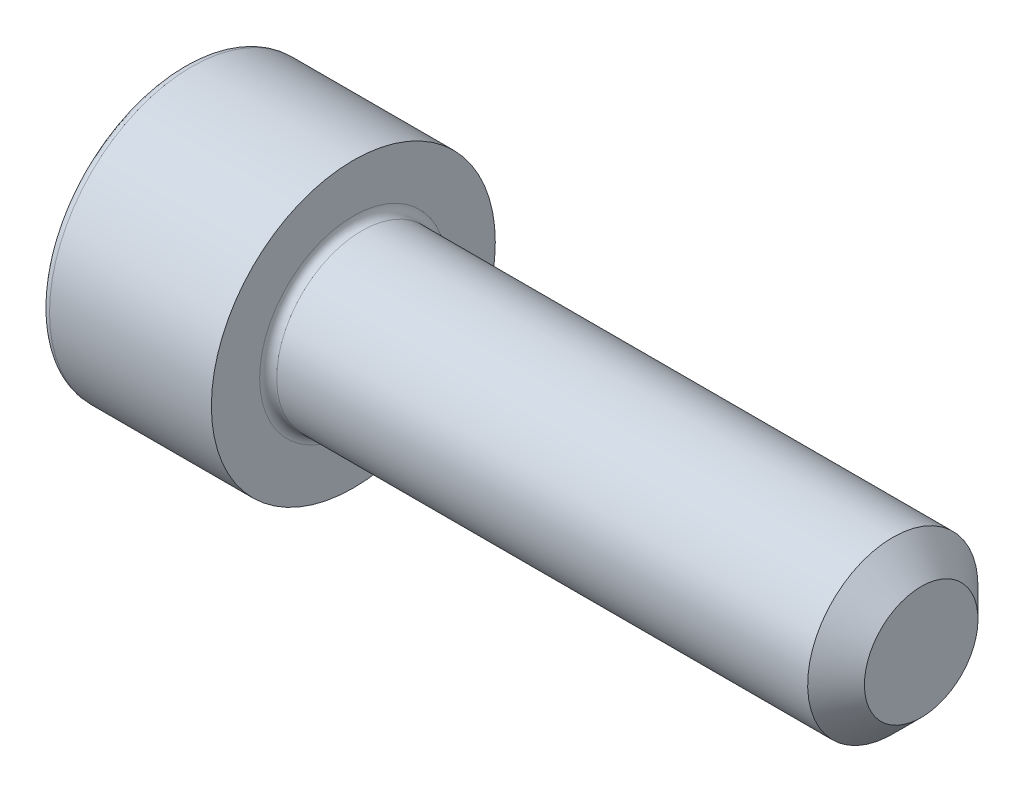
ISO-10303-21;
HEADER;
FILE_DESCRIPTION(('STEP AP214'),'2;1');
FILE_NAME('part.step','',(''),(''),'','','');
FILE_SCHEMA(('AUTOMOTIVE_DESIGN { 1 0 10303 214 1 1 1 1 }'));
ENDSEC;
DATA;
#1=APPLICATION_CONTEXT('core data for automotive mechanical design processes');
#2=APPLICATION_PROTOCOL_DEFINITION('international standard','automotive_design',2000,#1);
#3=PRODUCT_CONTEXT('',#1,'mechanical');
#4=PRODUCT('Part','Part','',(#3));
#5=PRODUCT_RELATED_PRODUCT_CATEGORY('part','',(#4));
#6=PRODUCT_DEFINITION_FORMATION('','',#4);
#7=PRODUCT_DEFINITION_CONTEXT('part definition',#1,'design');
#8=PRODUCT_DEFINITION('design','',#6,#7);
#9=PRODUCT_DEFINITION_SHAPE('','',#8);
#10=(LENGTH_UNIT() NAMED_UNIT(*) SI_UNIT(.MILLI.,.METRE.));
#11=(NAMED_UNIT(*) PLANE_ANGLE_UNIT() SI_UNIT($,.RADIAN.));
#12=(NAMED_UNIT(*) SI_UNIT($,.STERADIAN.) SOLID_ANGLE_UNIT());
#13=UNCERTAINTY_MEASURE_WITH_UNIT(LENGTH_MEASURE(1.E-05),#10,'distance_accuracy_value','');
#14=(GEOMETRIC_REPRESENTATION_CONTEXT(3) GLOBAL_UNCERTAINTY_ASSIGNED_CONTEXT((#13)) GLOBAL_UNIT_ASSIGNED_CONTEXT((#10,
#11,#12)) REPRESENTATION_CONTEXT('',''));
#15=CARTESIAN_POINT('',(0.,0.,0.));
#16=DIRECTION('',(0.,0.,1.));
#17=DIRECTION('',(1.,0.,0.));
#18=AXIS2_PLACEMENT_3D('',#15,#16,#17);
#19=CARTESIAN_POINT('',(0.,0.,0.));
#20=DIRECTION('',(-1.,0.,0.));
#21=DIRECTION('',(0.,-1.,0.));
#22=AXIS2_PLACEMENT_3D('',#19,#20,#21);
#23=PLANE('',#22);
#24=CARTESIAN_POINT('',(0.,0.,0.));
#25=DIRECTION('',(-1.,0.,0.));
#26=DIRECTION('',(0.,-1.,0.));
#27=AXIS2_PLACEMENT_3D('',#24,#25,#26);
#28=CIRCLE('',#27,4.7);
#29=CARTESIAN_POINT('',(0.,-4.7,0.));
#30=VERTEX_POINT('',#29);
#31=EDGE_CURVE('E158',#30,#30,#28,.T.);
#32=ORIENTED_EDGE('',*,*,#31,.T.);
#33=EDGE_LOOP('',(#32));
#34=FACE_BOUND('',#33,.T.);
#35=DIRECTION('',(0.,0.,-1.));
#36=VECTOR('',#35,1.);
#37=CARTESIAN_POINT('',(0.,2.5,1.44337567297407));
#38=LINE('',#37,#36);
#39=CARTESIAN_POINT('',(0.,2.5,1.44337567297407));
#40=VERTEX_POINT('',#39);
#41=CARTESIAN_POINT('',(0.,2.5,-1.44337567297406));
#42=VERTEX_POINT('',#41);
#43=EDGE_CURVE('E54',#40,#42,#38,.T.);
#44=ORIENTED_EDGE('',*,*,#43,.F.);
#45=DIRECTION('',(0.,0.866025403784439,-0.5));
#46=VECTOR('',#45,1.);
#47=CARTESIAN_POINT('',(0.,0.,2.88675134594813));
#48=LINE('',#47,#46);
#49=CARTESIAN_POINT('',(0.,0.,2.88675134594813));
#50=VERTEX_POINT('',#49);
#51=EDGE_CURVE('E137',#50,#40,#48,.T.);
#52=ORIENTED_EDGE('',*,*,#51,.F.);
#53=DIRECTION('',(0.,0.866025403784439,0.5));
#54=VECTOR('',#53,1.);
#55=CARTESIAN_POINT('',(0.,-2.5,1.44337567297406));
#56=LINE('',#55,#54);
#57=CARTESIAN_POINT('',(0.,-2.5,1.44337567297406));
#58=VERTEX_POINT('',#57);
#59=EDGE_CURVE('E135',#58,#50,#56,.T.);
#60=ORIENTED_EDGE('',*,*,#59,.F.);
#61=DIRECTION('',(0.,0.,1.));
#62=VECTOR('',#61,1.);
#63=CARTESIAN_POINT('',(0.,-2.5,-1.44337567297407));
#64=LINE('',#63,#62);
#65=CARTESIAN_POINT('',(0.,-2.5,-1.44337567297407));
#66=VERTEX_POINT('',#65);
#67=EDGE_CURVE('E102',#66,#58,#64,.T.);
#68=ORIENTED_EDGE('',*,*,#67,.F.);
#69=DIRECTION('',(0.,-0.866025403784439,0.5));
#70=VECTOR('',#69,1.);
#71=CARTESIAN_POINT('',(0.,0.,-2.88675134594813));
#72=LINE('',#71,#70);
#73=CARTESIAN_POINT('',(0.,0.,-2.88675134594813));
#74=VERTEX_POINT('',#73);
#75=EDGE_CURVE('E131',#74,#66,#72,.T.);
#76=ORIENTED_EDGE('',*,*,#75,.F.);
#77=DIRECTION('',(0.,-0.866025403784439,-0.5));
#78=VECTOR('',#77,1.);
#79=CARTESIAN_POINT('',(0.,2.5,-1.44337567297406));
#80=LINE('',#79,#78);
#81=EDGE_CURVE('E128',#42,#74,#80,.T.);
#82=ORIENTED_EDGE('',*,*,#81,.F.);
#83=EDGE_LOOP('',(#44,#52,#60,#68,#76,#82));
#84=FACE_BOUND('',#83,.T.);
#85=ADVANCED_FACE('F38',(#34,#84),#23,.T.);
#86=CARTESIAN_POINT('',(26.,0.,0.));
#87=DIRECTION('',(1.,0.,0.));
#88=DIRECTION('',(0.,1.,0.));
#89=AXIS2_PLACEMENT_3D('',#86,#87,#88);
#90=CYLINDRICAL_SURFACE('',#89,5.);
#91=CARTESIAN_POINT('',(0.300000000000002,0.,0.));
#92=DIRECTION('',(-1.,0.,0.));
#93=DIRECTION('',(0.,-1.,0.));
#94=AXIS2_PLACEMENT_3D('',#91,#92,#93);
#95=CIRCLE('',#94,5.);
#96=CARTESIAN_POINT('',(0.300000000000002,-5.,0.));
#97=VERTEX_POINT('',#96);
#98=EDGE_CURVE('E155',#97,#97,#95,.F.);
#99=ORIENTED_EDGE('',*,*,#98,.T.);
#100=EDGE_LOOP('',(#99));
#101=FACE_BOUND('',#100,.T.);
#102=CARTESIAN_POINT('',(6.,0.,0.));
#103=DIRECTION('',(1.,0.,0.));
#104=DIRECTION('',(0.,1.,0.));
#105=AXIS2_PLACEMENT_3D('',#102,#103,#104);
#106=CIRCLE('',#105,5.);
#107=CARTESIAN_POINT('',(6.,5.,0.));
#108=VERTEX_POINT('',#107);
#109=EDGE_CURVE('E141',#108,#108,#106,.T.);
#110=ORIENTED_EDGE('',*,*,#109,.F.);
#111=EDGE_LOOP('',(#110));
#112=FACE_BOUND('',#111,.T.);
#113=ADVANCED_FACE('F175',(#101,#112),#90,.T.);
#114=CARTESIAN_POINT('',(6.,5.,0.));
#115=DIRECTION('',(1.,0.,0.));
#116=DIRECTION('',(0.,1.,0.));
#117=AXIS2_PLACEMENT_3D('',#114,#115,#116);
#118=PLANE('',#117);
#119=CARTESIAN_POINT('',(6.,0.,0.));
#120=DIRECTION('',(1.,0.,0.));
#121=DIRECTION('',(0.,1.,0.));
#122=AXIS2_PLACEMENT_3D('',#119,#120,#121);
#123=CIRCLE('',#122,3.29999999999999);
#124=CARTESIAN_POINT('',(6.,3.3,0.));
#125=VERTEX_POINT('',#124);
#126=EDGE_CURVE('E152',#125,#125,#123,.F.);
#127=ORIENTED_EDGE('',*,*,#126,.T.);
#128=EDGE_LOOP('',(#127));
#129=FACE_BOUND('',#128,.T.);
#130=ORIENTED_EDGE('',*,*,#109,.T.);
#131=EDGE_LOOP('',(#130));
#132=FACE_BOUND('',#131,.T.);
#133=ADVANCED_FACE('F181',(#129,#132),#118,.T.);
#134=CARTESIAN_POINT('',(26.,0.,0.));
#135=DIRECTION('',(1.,0.,0.));
#136=DIRECTION('',(0.,1.,0.));
#137=AXIS2_PLACEMENT_3D('',#134,#135,#136);
#138=CYLINDRICAL_SURFACE('',#137,2.99999999999999);
#139=CARTESIAN_POINT('',(25.,0.,0.));
#140=DIRECTION('',(1.,0.,0.));
#141=DIRECTION('',(0.,1.,0.));
#142=AXIS2_PLACEMENT_3D('',#139,#140,#141);
#143=CIRCLE('',#142,2.99999999999999);
#144=CARTESIAN_POINT('',(25.,3.,0.));
#145=VERTEX_POINT('',#144);
#146=EDGE_CURVE('E11',#145,#145,#143,.F.);
#147=ORIENTED_EDGE('',*,*,#146,.T.);
#148=EDGE_LOOP('',(#147));
#149=FACE_BOUND('',#148,.T.);
#150=CARTESIAN_POINT('',(6.3,0.,0.));
#151=DIRECTION('',(1.,0.,0.));
#152=DIRECTION('',(0.,1.,0.));
#153=AXIS2_PLACEMENT_3D('',#150,#151,#152);
#154=CIRCLE('',#153,2.99999999999999);
#155=CARTESIAN_POINT('',(6.3,3.,0.));
#156=VERTEX_POINT('',#155);
#157=EDGE_CURVE('E149',#156,#156,#154,.T.);
#158=ORIENTED_EDGE('',*,*,#157,.T.);
#159=EDGE_LOOP('',(#158));
#160=FACE_BOUND('',#159,.T.);
#161=ADVANCED_FACE('F198',(#149,#160),#138,.T.);
#162=CARTESIAN_POINT('',(26.,3.,0.));
#163=DIRECTION('',(1.,0.,0.));
#164=DIRECTION('',(0.,1.,0.));
#165=AXIS2_PLACEMENT_3D('',#162,#163,#164);
#166=PLANE('',#165);
#167=CARTESIAN_POINT('',(26.,0.,0.));
#168=DIRECTION('',(1.,0.,0.));
#169=DIRECTION('',(0.,1.,0.));
#170=AXIS2_PLACEMENT_3D('',#167,#168,#169);
#171=CIRCLE('',#170,2.);
#172=CARTESIAN_POINT('',(26.,2.,0.));
#173=VERTEX_POINT('',#172);
#174=EDGE_CURVE('E47',#173,#173,#171,.T.);
#175=ORIENTED_EDGE('',*,*,#174,.T.);
#176=EDGE_LOOP('',(#175));
#177=FACE_BOUND('',#176,.T.);
#178=ADVANCED_FACE('F163',(#177),#166,.T.);
#179=CARTESIAN_POINT('',(2.5,2.5,1.44337567297407));
#180=DIRECTION('',(0.,1.,0.));
#181=DIRECTION('',(-1.,0.,0.));
#182=AXIS2_PLACEMENT_3D('',#179,#180,#181);
#183=PLANE('',#182);
#184=ORIENTED_EDGE('',*,*,#43,.T.);
#185=DIRECTION('',(-1.,0.,0.));
#186=VECTOR('',#185,1.);
#187=CARTESIAN_POINT('',(2.5,2.5,-1.44337567297406));
#188=LINE('',#187,#186);
#189=CARTESIAN_POINT('',(2.5,2.5,-1.44337567297406));
#190=VERTEX_POINT('',#189);
#191=EDGE_CURVE('E84',#190,#42,#188,.T.);
#192=ORIENTED_EDGE('',*,*,#191,.F.);
#193=DIRECTION('',(0.,0.,-1.));
#194=VECTOR('',#193,1.);
#195=CARTESIAN_POINT('',(2.5,2.5,1.44337567297407));
#196=LINE('',#195,#194);
#197=CARTESIAN_POINT('',(2.5,2.5,1.44337567297407));
#198=VERTEX_POINT('',#197);
#199=EDGE_CURVE('E139',#198,#190,#196,.T.);
#200=ORIENTED_EDGE('',*,*,#199,.F.);
#201=DIRECTION('',(-1.,0.,0.));
#202=VECTOR('',#201,1.);
#203=CARTESIAN_POINT('',(2.5,2.5,1.44337567297407));
#204=LINE('',#203,#202);
#205=EDGE_CURVE('E62',#198,#40,#204,.T.);
#206=ORIENTED_EDGE('',*,*,#205,.T.);
#207=EDGE_LOOP('',(#184,#192,#200,#206));
#208=FACE_BOUND('',#207,.T.);
#209=ADVANCED_FACE('F206',(#208),#183,.F.);
#210=CARTESIAN_POINT('',(2.5,0.,2.88675134594813));
#211=DIRECTION('',(0.,0.5,0.866025403784439));
#212=DIRECTION('',(0.,-0.866025403784439,0.5));
#213=AXIS2_PLACEMENT_3D('',#210,#211,#212);
#214=PLANE('',#213);
#215=ORIENTED_EDGE('',*,*,#51,.T.);
#216=ORIENTED_EDGE('',*,*,#205,.F.);
#217=DIRECTION('',(0.,0.866025403784439,-0.5));
#218=VECTOR('',#217,1.);
#219=CARTESIAN_POINT('',(2.5,0.,2.88675134594813));
#220=LINE('',#219,#218);
#221=CARTESIAN_POINT('',(2.5,0.,2.88675134594813));
#222=VERTEX_POINT('',#221);
#223=EDGE_CURVE('E114',#222,#198,#220,.T.);
#224=ORIENTED_EDGE('',*,*,#223,.F.);
#225=DIRECTION('',(-1.,0.,0.));
#226=VECTOR('',#225,1.);
#227=CARTESIAN_POINT('',(2.5,0.,2.88675134594813));
#228=LINE('',#227,#226);
#229=EDGE_CURVE('E106',#222,#50,#228,.T.);
#230=ORIENTED_EDGE('',*,*,#229,.T.);
#231=EDGE_LOOP('',(#215,#216,#224,#230));
#232=FACE_BOUND('',#231,.T.);
#233=ADVANCED_FACE('F212',(#232),#214,.F.);
#234=CARTESIAN_POINT('',(2.5,-2.5,1.44337567297406));
#235=DIRECTION('',(0.,-0.5,0.866025403784439));
#236=DIRECTION('',(0.,-0.866025403784439,-0.5));
#237=AXIS2_PLACEMENT_3D('',#234,#235,#236);
#238=PLANE('',#237);
#239=ORIENTED_EDGE('',*,*,#59,.T.);
#240=ORIENTED_EDGE('',*,*,#229,.F.);
#241=DIRECTION('',(0.,0.866025403784439,0.5));
#242=VECTOR('',#241,1.);
#243=CARTESIAN_POINT('',(2.5,-2.5,1.44337567297406));
#244=LINE('',#243,#242);
#245=CARTESIAN_POINT('',(2.5,-2.5,1.44337567297406));
#246=VERTEX_POINT('',#245);
#247=EDGE_CURVE('E110',#246,#222,#244,.T.);
#248=ORIENTED_EDGE('',*,*,#247,.F.);
#249=DIRECTION('',(-1.,0.,0.));
#250=VECTOR('',#249,1.);
#251=CARTESIAN_POINT('',(2.5,-2.5,1.44337567297406));
#252=LINE('',#251,#250);
#253=EDGE_CURVE('E95',#246,#58,#252,.T.);
#254=ORIENTED_EDGE('',*,*,#253,.T.);
#255=EDGE_LOOP('',(#239,#240,#248,#254));
#256=FACE_BOUND('',#255,.T.);
#257=ADVANCED_FACE('F111',(#256),#238,.F.);
#258=CARTESIAN_POINT('',(2.5,-2.5,-1.44337567297407));
#259=DIRECTION('',(0.,-1.,0.));
#260=DIRECTION('',(1.,0.,0.));
#261=AXIS2_PLACEMENT_3D('',#258,#259,#260);
#262=PLANE('',#261);
#263=ORIENTED_EDGE('',*,*,#67,.T.);
#264=ORIENTED_EDGE('',*,*,#253,.F.);
#265=DIRECTION('',(0.,0.,1.));
#266=VECTOR('',#265,1.);
#267=CARTESIAN_POINT('',(2.5,-2.5,-1.44337567297407));
#268=LINE('',#267,#266);
#269=CARTESIAN_POINT('',(2.5,-2.5,-1.44337567297407));
#270=VERTEX_POINT('',#269);
#271=EDGE_CURVE('E99',#270,#246,#268,.T.);
#272=ORIENTED_EDGE('',*,*,#271,.F.);
#273=DIRECTION('',(-1.,0.,0.));
#274=VECTOR('',#273,1.);
#275=CARTESIAN_POINT('',(2.5,-2.5,-1.44337567297407));
#276=LINE('',#275,#274);
#277=EDGE_CURVE('E107',#270,#66,#276,.T.);
#278=ORIENTED_EDGE('',*,*,#277,.T.);
#279=EDGE_LOOP('',(#263,#264,#272,#278));
#280=FACE_BOUND('',#279,.T.);
#281=ADVANCED_FACE('F97',(#280),#262,.F.);
#282=CARTESIAN_POINT('',(2.5,0.,-2.88675134594813));
#283=DIRECTION('',(0.,-0.5,-0.866025403784439));
#284=DIRECTION('',(0.,0.866025403784439,-0.5));
#285=AXIS2_PLACEMENT_3D('',#282,#283,#284);
#286=PLANE('',#285);
#287=ORIENTED_EDGE('',*,*,#75,.T.);
#288=ORIENTED_EDGE('',*,*,#277,.F.);
#289=DIRECTION('',(0.,-0.866025403784439,0.5));
#290=VECTOR('',#289,1.);
#291=CARTESIAN_POINT('',(2.5,0.,-2.88675134594813));
#292=LINE('',#291,#290);
#293=CARTESIAN_POINT('',(2.5,0.,-2.88675134594813));
#294=VERTEX_POINT('',#293);
#295=EDGE_CURVE('E120',#294,#270,#292,.T.);
#296=ORIENTED_EDGE('',*,*,#295,.F.);
#297=DIRECTION('',(-1.,0.,0.));
#298=VECTOR('',#297,1.);
#299=CARTESIAN_POINT('',(2.5,0.,-2.88675134594813));
#300=LINE('',#299,#298);
#301=EDGE_CURVE('E144',#294,#74,#300,.T.);
#302=ORIENTED_EDGE('',*,*,#301,.T.);
#303=EDGE_LOOP('',(#287,#288,#296,#302));
#304=FACE_BOUND('',#303,.T.);
#305=ADVANCED_FACE('F215',(#304),#286,.F.);
#306=CARTESIAN_POINT('',(2.5,2.5,-1.44337567297406));
#307=DIRECTION('',(0.,0.5,-0.866025403784439));
#308=DIRECTION('',(0.,0.866025403784439,0.5));
#309=AXIS2_PLACEMENT_3D('',#306,#307,#308);
#310=PLANE('',#309);
#311=ORIENTED_EDGE('',*,*,#81,.T.);
#312=ORIENTED_EDGE('',*,*,#301,.F.);
#313=DIRECTION('',(0.,-0.866025403784439,-0.5));
#314=VECTOR('',#313,1.);
#315=CARTESIAN_POINT('',(2.5,2.5,-1.44337567297406));
#316=LINE('',#315,#314);
#317=EDGE_CURVE('E122',#190,#294,#316,.T.);
#318=ORIENTED_EDGE('',*,*,#317,.F.);
#319=ORIENTED_EDGE('',*,*,#191,.T.);
#320=EDGE_LOOP('',(#311,#312,#318,#319));
#321=FACE_BOUND('',#320,.T.);
#322=ADVANCED_FACE('F192',(#321),#310,.F.);
#323=CARTESIAN_POINT('',(2.5,0.,0.));
#324=DIRECTION('',(-1.,0.,0.));
#325=DIRECTION('',(0.,-1.,0.));
#326=AXIS2_PLACEMENT_3D('',#323,#324,#325);
#327=PLANE('',#326);
#328=ORIENTED_EDGE('',*,*,#199,.T.);
#329=ORIENTED_EDGE('',*,*,#317,.T.);
#330=ORIENTED_EDGE('',*,*,#295,.T.);
#331=ORIENTED_EDGE('',*,*,#271,.T.);
#332=ORIENTED_EDGE('',*,*,#247,.T.);
#333=ORIENTED_EDGE('',*,*,#223,.T.);
#334=EDGE_LOOP('',(#328,#329,#330,#331,#332,#333));
#335=FACE_BOUND('',#334,.T.);
#336=ADVANCED_FACE('F117',(#335),#327,.T.);
#337=CARTESIAN_POINT('',(6.3,0.,0.));
#338=DIRECTION('',(1.,0.,0.));
#339=DIRECTION('',(0.,1.,0.));
#340=AXIS2_PLACEMENT_3D('',#337,#338,#339);
#341=TOROIDAL_SURFACE('',#340,3.29999999999999,0.3);
#342=ORIENTED_EDGE('',*,*,#126,.F.);
#343=EDGE_LOOP('',(#342));
#344=FACE_BOUND('',#343,.T.);
#345=ORIENTED_EDGE('',*,*,#157,.F.);
#346=EDGE_LOOP('',(#345));
#347=FACE_BOUND('',#346,.T.);
#348=ADVANCED_FACE('F171',(#344,#347),#341,.F.);
#349=CARTESIAN_POINT('',(0.300000000000002,0.,0.));
#350=DIRECTION('',(-1.,0.,0.));
#351=DIRECTION('',(0.,-1.,0.));
#352=AXIS2_PLACEMENT_3D('',#349,#350,#351);
#353=TOROIDAL_SURFACE('',#352,4.7,0.3);
#354=ORIENTED_EDGE('',*,*,#31,.F.);
#355=EDGE_LOOP('',(#354));
#356=FACE_BOUND('',#355,.T.);
#357=ORIENTED_EDGE('',*,*,#98,.F.);
#358=EDGE_LOOP('',(#357));
#359=FACE_BOUND('',#358,.T.);
#360=ADVANCED_FACE('F166',(#356,#359),#353,.T.);
#361=CARTESIAN_POINT('',(26.,0.,0.));
#362=DIRECTION('',(-1.,0.,0.));
#363=DIRECTION('',(0.,-1.,0.));
#364=AXIS2_PLACEMENT_3D('',#361,#362,#363);
#365=CONICAL_SURFACE('',#364,2.,0.785398163397446);
#366=ORIENTED_EDGE('',*,*,#146,.F.);
#367=EDGE_LOOP('',(#366));
#368=FACE_BOUND('',#367,.T.);
#369=ORIENTED_EDGE('',*,*,#174,.F.);
#370=EDGE_LOOP('',(#369));
#371=FACE_BOUND('',#370,.T.);
#372=ADVANCED_FACE('F41',(#368,#371),#365,.T.);
#373=CLOSED_SHELL('',(#85,#113,#133,#161,#178,#209,#233,#257,#281,#305,#322,#336,#348,#360,#372));
#374=MANIFOLD_SOLID_BREP('B2',#373);
#375=ADVANCED_BREP_SHAPE_REPRESENTATION('',(#18,#374),#14);
#376=SHAPE_DEFINITION_REPRESENTATION(#9,#375);
ENDSEC;
END-ISO-10303-21;
